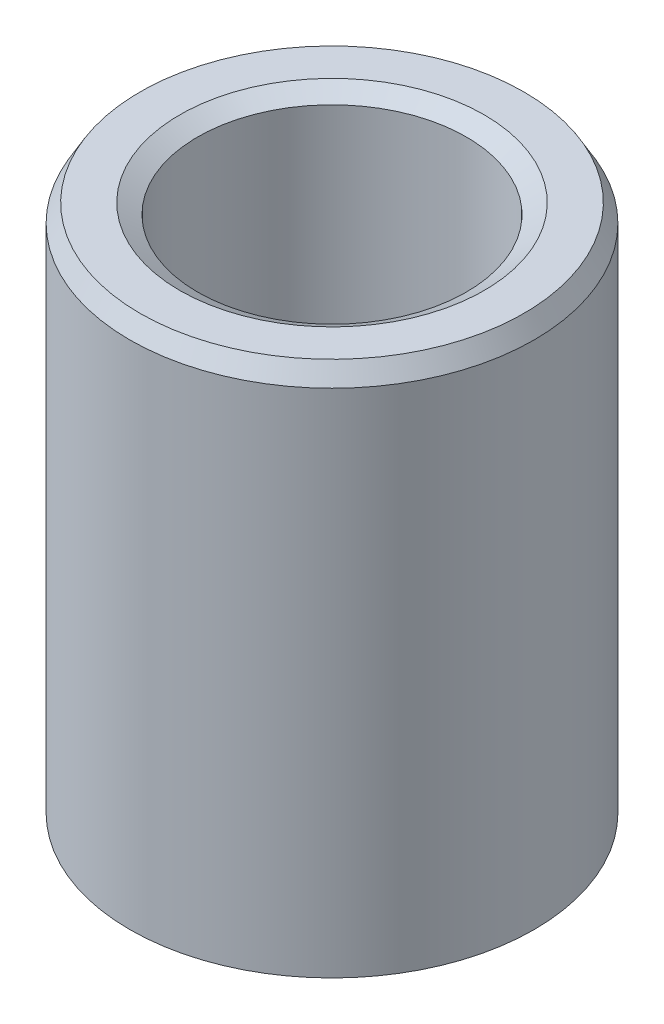
ISO-10303-21;
HEADER;
FILE_DESCRIPTION(('STEP AP214'),'2;1');
FILE_NAME('part.step','',(''),(''),'','','');
FILE_SCHEMA(('AUTOMOTIVE_DESIGN { 1 0 10303 214 1 1 1 1 }'));
ENDSEC;
DATA;
#1=APPLICATION_CONTEXT('core data for automotive mechanical design processes');
#2=APPLICATION_PROTOCOL_DEFINITION('international standard','automotive_design',2000,#1);
#3=PRODUCT_CONTEXT('',#1,'mechanical');
#4=PRODUCT('Part','Part','',(#3));
#5=PRODUCT_RELATED_PRODUCT_CATEGORY('part','',(#4));
#6=PRODUCT_DEFINITION_FORMATION('','',#4);
#7=PRODUCT_DEFINITION_CONTEXT('part definition',#1,'design');
#8=PRODUCT_DEFINITION('design','',#6,#7);
#9=PRODUCT_DEFINITION_SHAPE('','',#8);
#10=(LENGTH_UNIT() NAMED_UNIT(*) SI_UNIT(.MILLI.,.METRE.));
#11=(NAMED_UNIT(*) PLANE_ANGLE_UNIT() SI_UNIT($,.RADIAN.));
#12=(NAMED_UNIT(*) SI_UNIT($,.STERADIAN.) SOLID_ANGLE_UNIT());
#13=UNCERTAINTY_MEASURE_WITH_UNIT(LENGTH_MEASURE(1.E-05),#10,'distance_accuracy_value','');
#14=(GEOMETRIC_REPRESENTATION_CONTEXT(3) GLOBAL_UNCERTAINTY_ASSIGNED_CONTEXT((#13)) GLOBAL_UNIT_ASSIGNED_CONTEXT((#10,
#11,#12)) REPRESENTATION_CONTEXT('',''));
#15=CARTESIAN_POINT('',(0.,0.,0.));
#16=DIRECTION('',(0.,0.,1.));
#17=DIRECTION('',(1.,0.,0.));
#18=AXIS2_PLACEMENT_3D('',#15,#16,#17);
#19=CARTESIAN_POINT('',(0.,26.6514299581745,0.));
#20=DIRECTION('',(0.,-1.,0.));
#21=DIRECTION('',(0.,0.,-1.));
#22=AXIS2_PLACEMENT_3D('',#19,#20,#21);
#23=CYLINDRICAL_SURFACE('',#22,10.);
#24=CARTESIAN_POINT('',(0.,0.508606903140599,0.));
#25=DIRECTION('',(0.,1.,0.));
#26=DIRECTION('',(0.,0.,1.));
#27=AXIS2_PLACEMENT_3D('',#24,#25,#26);
#28=CIRCLE('',#27,10.);
#29=CARTESIAN_POINT('',(0.,0.508606903140599,10.));
#30=VERTEX_POINT('',#29);
#31=EDGE_CURVE('E10',#30,#30,#28,.T.);
#32=ORIENTED_EDGE('',*,*,#31,.T.);
#33=EDGE_LOOP('',(#32));
#34=FACE_BOUND('',#33,.T.);
#35=CARTESIAN_POINT('',(0.,25.7704969608547,0.));
#36=DIRECTION('',(0.,1.,0.));
#37=DIRECTION('',(0.,0.,1.));
#38=AXIS2_PLACEMENT_3D('',#35,#36,#37);
#39=CIRCLE('',#38,10.);
#40=CARTESIAN_POINT('',(0.,25.7704969608547,10.));
#41=VERTEX_POINT('',#40);
#42=EDGE_CURVE('E50',#41,#41,#39,.F.);
#43=ORIENTED_EDGE('',*,*,#42,.T.);
#44=EDGE_LOOP('',(#43));
#45=FACE_BOUND('',#44,.T.);
#46=ADVANCED_FACE('F39',(#34,#45),#23,.T.);
#47=CARTESIAN_POINT('',(0.,26.6514299581745,0.));
#48=DIRECTION('',(0.,1.,0.));
#49=DIRECTION('',(0.,0.,1.));
#50=AXIS2_PLACEMENT_3D('',#47,#48,#49);
#51=PLANE('',#50);
#52=CARTESIAN_POINT('',(0.,26.6514299581745,0.));
#53=DIRECTION('',(0.,1.,0.));
#54=DIRECTION('',(0.,0.,1.));
#55=AXIS2_PLACEMENT_3D('',#52,#53,#54);
#56=CIRCLE('',#55,7.52877673091883);
#57=CARTESIAN_POINT('',(0.,26.6514299581745,7.52877673091883));
#58=VERTEX_POINT('',#57);
#59=EDGE_CURVE('E58',#58,#58,#56,.F.);
#60=ORIENTED_EDGE('',*,*,#59,.T.);
#61=EDGE_LOOP('',(#60));
#62=FACE_BOUND('',#61,.T.);
#63=CARTESIAN_POINT('',(0.,26.6514299581745,0.));
#64=DIRECTION('',(0.,1.,0.));
#65=DIRECTION('',(0.,0.,1.));
#66=AXIS2_PLACEMENT_3D('',#63,#64,#65);
#67=CIRCLE('',#66,9.49139309685941);
#68=CARTESIAN_POINT('',(0.,26.6514299581745,9.49139309685941));
#69=VERTEX_POINT('',#68);
#70=EDGE_CURVE('E61',#69,#69,#67,.T.);
#71=ORIENTED_EDGE('',*,*,#70,.T.);
#72=EDGE_LOOP('',(#71));
#73=FACE_BOUND('',#72,.T.);
#74=ADVANCED_FACE('F88',(#62,#73),#51,.T.);
#75=CARTESIAN_POINT('',(0.,0.,0.));
#76=DIRECTION('',(0.,1.,0.));
#77=DIRECTION('',(0.,0.,1.));
#78=AXIS2_PLACEMENT_3D('',#75,#76,#77);
#79=PLANE('',#78);
#80=CARTESIAN_POINT('',(0.,0.,0.));
#81=DIRECTION('',(0.,1.,0.));
#82=DIRECTION('',(0.,0.,1.));
#83=AXIS2_PLACEMENT_3D('',#80,#81,#82);
#84=CIRCLE('',#83,7.15645063673965);
#85=CARTESIAN_POINT('',(0.,0.,7.15645063673965));
#86=VERTEX_POINT('',#85);
#87=EDGE_CURVE('E51',#86,#86,#84,.T.);
#88=ORIENTED_EDGE('',*,*,#87,.T.);
#89=EDGE_LOOP('',(#88));
#90=FACE_BOUND('',#89,.T.);
#91=CARTESIAN_POINT('',(0.,0.,0.));
#92=DIRECTION('',(0.,1.,0.));
#93=DIRECTION('',(0.,0.,1.));
#94=AXIS2_PLACEMENT_3D('',#91,#92,#93);
#95=CIRCLE('',#94,9.11906700268021);
#96=CARTESIAN_POINT('',(0.,0.,9.11906700268021));
#97=VERTEX_POINT('',#96);
#98=EDGE_CURVE('E54',#97,#97,#95,.F.);
#99=ORIENTED_EDGE('',*,*,#98,.T.);
#100=EDGE_LOOP('',(#99));
#101=FACE_BOUND('',#100,.T.);
#102=ADVANCED_FACE('F83',(#90,#101),#79,.F.);
#103=CARTESIAN_POINT('',(0.,26.6514299581745,0.));
#104=DIRECTION('',(0.,-1.,0.));
#105=DIRECTION('',(0.,0.,-1.));
#106=AXIS2_PLACEMENT_3D('',#103,#104,#105);
#107=CYLINDRICAL_SURFACE('',#106,6.64784373359905);
#108=CARTESIAN_POINT('',(0.,26.1428230550339,0.));
#109=DIRECTION('',(0.,1.,0.));
#110=DIRECTION('',(0.,0.,1.));
#111=AXIS2_PLACEMENT_3D('',#108,#109,#110);
#112=CIRCLE('',#111,6.64784373359905);
#113=CARTESIAN_POINT('',(0.,26.1428230550339,6.64784373359905));
#114=VERTEX_POINT('',#113);
#115=EDGE_CURVE('E67',#114,#114,#112,.T.);
#116=ORIENTED_EDGE('',*,*,#115,.T.);
#117=EDGE_LOOP('',(#116));
#118=FACE_BOUND('',#117,.T.);
#119=CARTESIAN_POINT('',(0.,0.880932997319797,0.));
#120=DIRECTION('',(0.,1.,0.));
#121=DIRECTION('',(0.,0.,1.));
#122=AXIS2_PLACEMENT_3D('',#119,#120,#121);
#123=CIRCLE('',#122,6.64784373359905);
#124=CARTESIAN_POINT('',(0.,0.880932997319797,6.64784373359905));
#125=VERTEX_POINT('',#124);
#126=EDGE_CURVE('E69',#125,#125,#123,.F.);
#127=ORIENTED_EDGE('',*,*,#126,.T.);
#128=EDGE_LOOP('',(#127));
#129=FACE_BOUND('',#128,.T.);
#130=ADVANCED_FACE('F71',(#118,#129),#107,.F.);
#131=CARTESIAN_POINT('',(0.,26.1428230550339,0.));
#132=DIRECTION('',(0.,1.,0.));
#133=DIRECTION('',(0.,0.,1.));
#134=AXIS2_PLACEMENT_3D('',#131,#132,#133);
#135=CONICAL_SURFACE('',#134,6.64784373359905,1.0471975511966);
#136=ORIENTED_EDGE('',*,*,#59,.F.);
#137=EDGE_LOOP('',(#136));
#138=FACE_BOUND('',#137,.T.);
#139=ORIENTED_EDGE('',*,*,#115,.F.);
#140=EDGE_LOOP('',(#139));
#141=FACE_BOUND('',#140,.T.);
#142=ADVANCED_FACE('F77',(#138,#141),#135,.F.);
#143=CARTESIAN_POINT('',(0.,0.,0.));
#144=DIRECTION('',(0.,-1.,0.));
#145=DIRECTION('',(0.,0.,-1.));
#146=AXIS2_PLACEMENT_3D('',#143,#144,#145);
#147=CONICAL_SURFACE('',#146,7.15645063673965,0.523598775598292);
#148=ORIENTED_EDGE('',*,*,#126,.F.);
#149=EDGE_LOOP('',(#148));
#150=FACE_BOUND('',#149,.T.);
#151=ORIENTED_EDGE('',*,*,#87,.F.);
#152=EDGE_LOOP('',(#151));
#153=FACE_BOUND('',#152,.T.);
#154=ADVANCED_FACE('F73',(#150,#153),#147,.F.);
#155=CARTESIAN_POINT('',(0.,0.508606903140599,0.));
#156=DIRECTION('',(0.,1.,0.));
#157=DIRECTION('',(0.,0.,1.));
#158=AXIS2_PLACEMENT_3D('',#155,#156,#157);
#159=CONICAL_SURFACE('',#158,10.,1.0471975511966);
#160=ORIENTED_EDGE('',*,*,#98,.F.);
#161=EDGE_LOOP('',(#160));
#162=FACE_BOUND('',#161,.T.);
#163=ORIENTED_EDGE('',*,*,#31,.F.);
#164=EDGE_LOOP('',(#163));
#165=FACE_BOUND('',#164,.T.);
#166=ADVANCED_FACE('F76',(#162,#165),#159,.T.);
#167=CARTESIAN_POINT('',(0.,26.6514299581745,0.));
#168=DIRECTION('',(0.,-1.,0.));
#169=DIRECTION('',(0.,0.,-1.));
#170=AXIS2_PLACEMENT_3D('',#167,#168,#169);
#171=CONICAL_SURFACE('',#170,9.49139309685941,0.523598775598293);
#172=ORIENTED_EDGE('',*,*,#42,.F.);
#173=EDGE_LOOP('',(#172));
#174=FACE_BOUND('',#173,.T.);
#175=ORIENTED_EDGE('',*,*,#70,.F.);
#176=EDGE_LOOP('',(#175));
#177=FACE_BOUND('',#176,.T.);
#178=ADVANCED_FACE('F45',(#174,#177),#171,.T.);
#179=CLOSED_SHELL('',(#46,#74,#102,#130,#142,#154,#166,#178));
#180=MANIFOLD_SOLID_BREP('B2',#179);
#181=ADVANCED_BREP_SHAPE_REPRESENTATION('',(#18,#180),#14);
#182=SHAPE_DEFINITION_REPRESENTATION(#9,#181);
ENDSEC;
END-ISO-10303-21;
